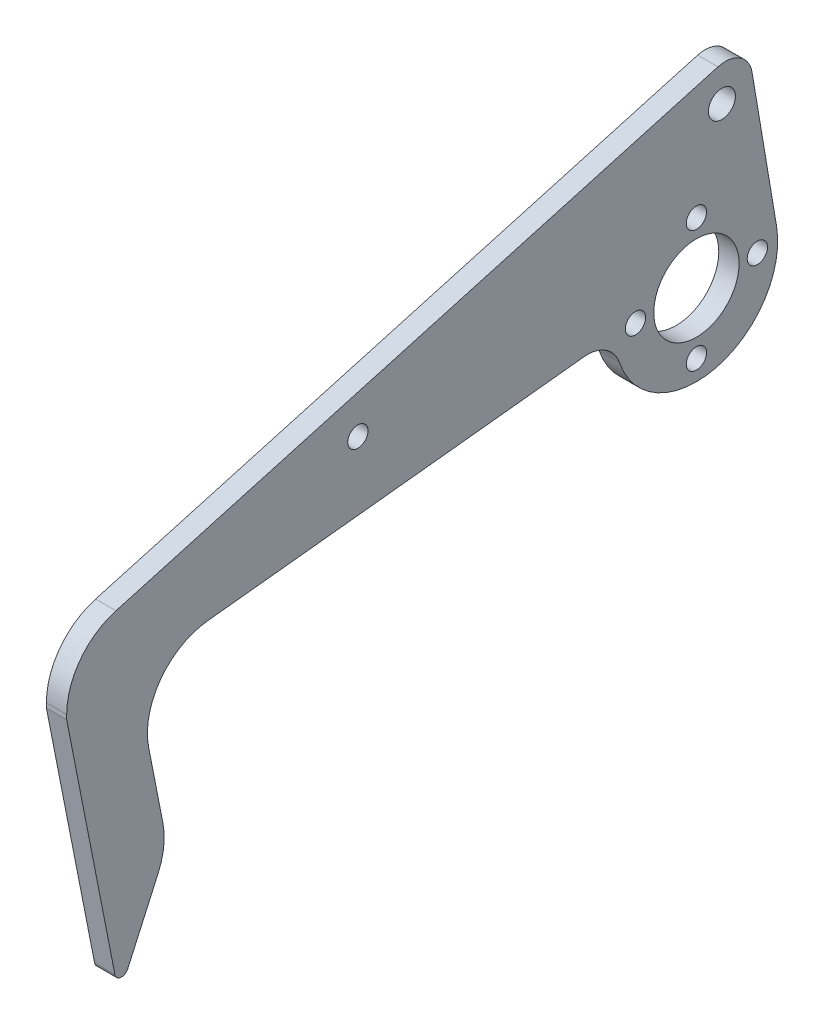
ISO-10303-21;
HEADER;
FILE_DESCRIPTION(('STEP AP214'),'2;1');
FILE_NAME('part.step','',(''),(''),'','','');
FILE_SCHEMA(('AUTOMOTIVE_DESIGN { 1 0 10303 214 1 1 1 1 }'));
ENDSEC;
DATA;
#1=APPLICATION_CONTEXT('core data for automotive mechanical design processes');
#2=APPLICATION_PROTOCOL_DEFINITION('international standard','automotive_design',2000,#1);
#3=PRODUCT_CONTEXT('',#1,'mechanical');
#4=PRODUCT('Part','Part','',(#3));
#5=PRODUCT_RELATED_PRODUCT_CATEGORY('part','',(#4));
#6=PRODUCT_DEFINITION_FORMATION('','',#4);
#7=PRODUCT_DEFINITION_CONTEXT('part definition',#1,'design');
#8=PRODUCT_DEFINITION('design','',#6,#7);
#9=PRODUCT_DEFINITION_SHAPE('','',#8);
#10=(LENGTH_UNIT() NAMED_UNIT(*) SI_UNIT(.MILLI.,.METRE.));
#11=(NAMED_UNIT(*) PLANE_ANGLE_UNIT() SI_UNIT($,.RADIAN.));
#12=(NAMED_UNIT(*) SI_UNIT($,.STERADIAN.) SOLID_ANGLE_UNIT());
#13=UNCERTAINTY_MEASURE_WITH_UNIT(LENGTH_MEASURE(1.E-05),#10,'distance_accuracy_value','');
#14=(GEOMETRIC_REPRESENTATION_CONTEXT(3) GLOBAL_UNCERTAINTY_ASSIGNED_CONTEXT((#13)) GLOBAL_UNIT_ASSIGNED_CONTEXT((#10,
#11,#12)) REPRESENTATION_CONTEXT('',''));
#15=CARTESIAN_POINT('',(0.,0.,0.));
#16=DIRECTION('',(0.,0.,1.));
#17=DIRECTION('',(1.,0.,0.));
#18=AXIS2_PLACEMENT_3D('',#15,#16,#17);
#19=CARTESIAN_POINT('',(3.,0.,0.));
#20=DIRECTION('',(-1.,0.,0.));
#21=DIRECTION('',(0.,0.,1.));
#22=AXIS2_PLACEMENT_3D('',#19,#20,#21);
#23=CYLINDRICAL_SURFACE('',#22,12.);
#24=CARTESIAN_POINT('',(3.,0.,0.));
#25=DIRECTION('',(1.,0.,0.));
#26=DIRECTION('',(0.,0.,-1.));
#27=AXIS2_PLACEMENT_3D('',#24,#25,#26);
#28=CIRCLE('',#27,12.);
#29=CARTESIAN_POINT('',(3.,-3.86044776965129,11.3620835685095));
#30=VERTEX_POINT('',#29);
#31=CARTESIAN_POINT('',(3.,1.99138832062666,-11.8336119826734));
#32=VERTEX_POINT('',#31);
#33=EDGE_CURVE('E267',#30,#32,#28,.T.);
#34=ORIENTED_EDGE('',*,*,#33,.F.);
#35=DIRECTION('',(-1.,0.,0.));
#36=VECTOR('',#35,1.);
#37=CARTESIAN_POINT('',(3.,-3.86044776965129,11.3620835685095));
#38=LINE('',#37,#36);
#39=CARTESIAN_POINT('',(0.,-3.86044776965129,11.3620835685095));
#40=VERTEX_POINT('',#39);
#41=EDGE_CURVE('E54',#30,#40,#38,.T.);
#42=ORIENTED_EDGE('',*,*,#41,.T.);
#43=CARTESIAN_POINT('',(0.,0.,0.));
#44=DIRECTION('',(1.,0.,0.));
#45=DIRECTION('',(0.,0.,-1.));
#46=AXIS2_PLACEMENT_3D('',#43,#44,#45);
#47=CIRCLE('',#46,12.);
#48=CARTESIAN_POINT('',(0.,1.99138832062666,-11.8336119826734));
#49=VERTEX_POINT('',#48);
#50=EDGE_CURVE('E264',#40,#49,#47,.T.);
#51=ORIENTED_EDGE('',*,*,#50,.T.);
#52=DIRECTION('',(1.,0.,0.));
#53=VECTOR('',#52,1.);
#54=CARTESIAN_POINT('',(0.,1.99138832062666,-11.8336119826734));
#55=LINE('',#54,#53);
#56=EDGE_CURVE('E223',#49,#32,#55,.T.);
#57=ORIENTED_EDGE('',*,*,#56,.T.);
#58=EDGE_LOOP('',(#34,#42,#51,#57));
#59=FACE_BOUND('',#58,.T.);
#60=ADVANCED_FACE('F39',(#59),#23,.T.);
#61=CARTESIAN_POINT('',(3.,0.,0.));
#62=DIRECTION('',(1.,0.,0.));
#63=DIRECTION('',(0.,0.,-1.));
#64=AXIS2_PLACEMENT_3D('',#61,#62,#63);
#65=PLANE('',#64);
#66=DIRECTION('',(0.,0.981180262311398,0.19309400003764));
#67=VECTOR('',#66,1.);
#68=CARTESIAN_POINT('',(3.,-8.70416584597603,93.));
#69=LINE('',#68,#67);
#70=CARTESIAN_POINT('',(3.,-44.8725053736254,85.8821546637504));
#71=VERTEX_POINT('',#70);
#72=CARTESIAN_POINT('',(3.,-8.70416584597603,93.));
#73=VERTEX_POINT('',#72);
#74=EDGE_CURVE('E305',#71,#73,#69,.T.);
#75=ORIENTED_EDGE('',*,*,#74,.F.);
#76=CARTESIAN_POINT('',(3.,-44.6794113735878,84.9009744014391));
#77=DIRECTION('',(1.,0.,0.));
#78=DIRECTION('',(0.,0.,-1.));
#79=AXIS2_PLACEMENT_3D('',#76,#77,#78);
#80=CIRCLE('',#79,1.);
#81=CARTESIAN_POINT('',(3.,-45.0896347817384,83.9889893382909));
#82=VERTEX_POINT('',#81);
#83=EDGE_CURVE('E188',#71,#82,#80,.T.);
#84=ORIENTED_EDGE('',*,*,#83,.T.);
#85=DIRECTION('',(0.,-0.911985063148122,0.410223408150628));
#86=VECTOR('',#85,1.);
#87=CARTESIAN_POINT('',(3.,-47.951376338432,85.2762399984944));
#88=LINE('',#87,#86);
#89=CARTESIAN_POINT('',(3.,-35.0654148019241,79.479957501765));
#90=VERTEX_POINT('',#89);
#91=EDGE_CURVE('E300',#90,#82,#88,.T.);
#92=ORIENTED_EDGE('',*,*,#91,.F.);
#93=CARTESIAN_POINT('',(3.,-30.9631807204178,88.5998081332462));
#94=DIRECTION('',(1.,0.,0.));
#95=DIRECTION('',(0.,0.,-1.));
#96=AXIS2_PLACEMENT_3D('',#93,#94,#95);
#97=CIRCLE('',#96,10.);
#98=CARTESIAN_POINT('',(3.,-29.0322407200414,78.7880055101322));
#99=VERTEX_POINT('',#98);
#100=EDGE_CURVE('E164',#90,#99,#97,.T.);
#101=ORIENTED_EDGE('',*,*,#100,.T.);
#102=DIRECTION('',(0.,-0.981180262311398,-0.19309400003764));
#103=VECTOR('',#102,1.);
#104=CARTESIAN_POINT('',(3.,-32.1590840277146,78.172649999059));
#105=LINE('',#104,#103);
#106=CARTESIAN_POINT('',(3.,-18.3372810833477,80.8927487625345));
#107=VERTEX_POINT('',#106);
#108=EDGE_CURVE('E299',#107,#99,#105,.T.);
#109=ORIENTED_EDGE('',*,*,#108,.F.);
#110=CARTESIAN_POINT('',(3.,-16.4063410829713,71.0809461394205));
#111=DIRECTION('',(1.,0.,0.));
#112=DIRECTION('',(0.,0.,-1.));
#113=AXIS2_PLACEMENT_3D('',#110,#111,#112);
#114=CIRCLE('',#113,10.);
#115=CARTESIAN_POINT('',(3.,-6.46358282116851,72.1493833848179));
#116=VERTEX_POINT('',#115);
#117=EDGE_CURVE('E178',#107,#116,#114,.F.);
#118=ORIENTED_EDGE('',*,*,#117,.T.);
#119=DIRECTION('',(0.,-0.106843724539728,0.99427582618028));
#120=VECTOR('',#119,1.);
#121=CARTESIAN_POINT('',(3.,1.274785589867,0.136986977682256));
#122=LINE('',#121,#120);
#123=CARTESIAN_POINT('',(3.,-0.497588542771267,16.6305036780872));
#124=VERTEX_POINT('',#123);
#125=EDGE_CURVE('E197',#124,#116,#122,.T.);
#126=ORIENTED_EDGE('',*,*,#125,.F.);
#127=CARTESIAN_POINT('',(3.,-5.46896767367267,16.0962850553885));
#128=DIRECTION('',(1.,0.,0.));
#129=DIRECTION('',(0.,0.,-1.));
#130=AXIS2_PLACEMENT_3D('',#127,#128,#129);
#131=CIRCLE('',#130,5.);
#132=EDGE_CURVE('E47',#124,#30,#131,.F.);
#133=ORIENTED_EDGE('',*,*,#132,.T.);
#134=ORIENTED_EDGE('',*,*,#33,.T.);
#135=DIRECTION('',(0.,0.986134331889451,0.165949026718888));
#136=VECTOR('',#135,1.);
#137=CARTESIAN_POINT('',(3.,1.99138832062666,-11.8336119826734));
#138=LINE('',#137,#136);
#139=CARTESIAN_POINT('',(3.,23.5115599714681,-8.2121464025856));
#140=VERTEX_POINT('',#139);
#141=EDGE_CURVE('E215',#32,#140,#138,.T.);
#142=ORIENTED_EDGE('',*,*,#141,.T.);
#143=CARTESIAN_POINT('',(3.,22.8477638645925,-4.2676090750278));
#144=DIRECTION('',(1.,0.,0.));
#145=DIRECTION('',(0.,0.,-1.));
#146=AXIS2_PLACEMENT_3D('',#143,#144,#145);
#147=CIRCLE('',#146,4.);
#148=CARTESIAN_POINT('',(3.,26.6971591930867,-3.18033928101759));
#149=VERTEX_POINT('',#148);
#150=EDGE_CURVE('E158',#140,#149,#147,.T.);
#151=ORIENTED_EDGE('',*,*,#150,.T.);
#152=DIRECTION('',(0.,0.271817448502551,-0.962348832123551));
#153=VECTOR('',#152,1.);
#154=CARTESIAN_POINT('',(3.,23.892723580228,6.7485499483835));
#155=LINE('',#154,#153);
#156=CARTESIAN_POINT('',(3.,1.58758729883579,85.7181744850255));
#157=VERTEX_POINT('',#156);
#158=EDGE_CURVE('E141',#157,#149,#155,.T.);
#159=ORIENTED_EDGE('',*,*,#158,.F.);
#160=CARTESIAN_POINT('',(3.,-8.03590102239973,83.));
#161=DIRECTION('',(1.,0.,0.));
#162=DIRECTION('',(0.,0.,-1.));
#163=AXIS2_PLACEMENT_3D('',#160,#161,#162);
#164=CIRCLE('',#163,10.);
#165=CARTESIAN_POINT('',(3.,-8.03590102239973,93.));
#166=VERTEX_POINT('',#165);
#167=EDGE_CURVE('E154',#157,#166,#164,.T.);
#168=ORIENTED_EDGE('',*,*,#167,.T.);
#169=DIRECTION('',(0.,1.,0.));
#170=VECTOR('',#169,1.);
#171=CARTESIAN_POINT('',(3.,-8.70416584597603,93.));
#172=LINE('',#171,#170);
#173=EDGE_CURVE('E205',#73,#166,#172,.T.);
#174=ORIENTED_EDGE('',*,*,#173,.F.);
#175=EDGE_LOOP('',(#75,#84,#92,#101,#109,#118,#126,#133,#134,#142,#151,#159,#168,#174));
#176=FACE_BOUND('',#175,.T.);
#177=CARTESIAN_POINT('',(3.,6.,50.));
#178=DIRECTION('',(-1.,0.,0.));
#179=DIRECTION('',(0.,0.,1.));
#180=AXIS2_PLACEMENT_3D('',#177,#178,#179);
#181=CIRCLE('',#180,1.5);
#182=CARTESIAN_POINT('',(3.,6.,51.5));
#183=VERTEX_POINT('',#182);
#184=EDGE_CURVE('E231',#183,#183,#181,.T.);
#185=ORIENTED_EDGE('',*,*,#184,.T.);
#186=EDGE_LOOP('',(#185));
#187=FACE_BOUND('',#186,.T.);
#188=CARTESIAN_POINT('',(3.,-9.,0.));
#189=DIRECTION('',(1.,0.,0.));
#190=DIRECTION('',(0.,0.,-1.));
#191=AXIS2_PLACEMENT_3D('',#188,#189,#190);
#192=CIRCLE('',#191,1.5);
#193=CARTESIAN_POINT('',(3.,-9.,-1.5));
#194=VERTEX_POINT('',#193);
#195=EDGE_CURVE('E243',#194,#194,#192,.T.);
#196=ORIENTED_EDGE('',*,*,#195,.F.);
#197=EDGE_LOOP('',(#196));
#198=FACE_BOUND('',#197,.T.);
#199=CARTESIAN_POINT('',(3.,0.,0.));
#200=DIRECTION('',(1.,0.,0.));
#201=DIRECTION('',(0.,0.,-1.));
#202=AXIS2_PLACEMENT_3D('',#199,#200,#201);
#203=CIRCLE('',#202,6.3);
#204=CARTESIAN_POINT('',(3.,0.,-6.3));
#205=VERTEX_POINT('',#204);
#206=EDGE_CURVE('E255',#205,#205,#203,.T.);
#207=ORIENTED_EDGE('',*,*,#206,.F.);
#208=EDGE_LOOP('',(#207));
#209=FACE_BOUND('',#208,.T.);
#210=CARTESIAN_POINT('',(3.,9.,0.));
#211=DIRECTION('',(1.,0.,0.));
#212=DIRECTION('',(0.,0.,-1.));
#213=AXIS2_PLACEMENT_3D('',#210,#211,#212);
#214=CIRCLE('',#213,1.5);
#215=CARTESIAN_POINT('',(3.,9.,-1.5));
#216=VERTEX_POINT('',#215);
#217=EDGE_CURVE('E261',#216,#216,#214,.T.);
#218=ORIENTED_EDGE('',*,*,#217,.F.);
#219=EDGE_LOOP('',(#218));
#220=FACE_BOUND('',#219,.T.);
#221=CARTESIAN_POINT('',(3.,0.,-9.));
#222=DIRECTION('',(1.,0.,0.));
#223=DIRECTION('',(0.,0.,-1.));
#224=AXIS2_PLACEMENT_3D('',#221,#222,#223);
#225=CIRCLE('',#224,1.5);
#226=CARTESIAN_POINT('',(3.,0.,-10.5));
#227=VERTEX_POINT('',#226);
#228=EDGE_CURVE('E249',#227,#227,#225,.T.);
#229=ORIENTED_EDGE('',*,*,#228,.F.);
#230=EDGE_LOOP('',(#229));
#231=FACE_BOUND('',#230,.T.);
#232=CARTESIAN_POINT('',(3.,0.,9.));
#233=DIRECTION('',(1.,0.,0.));
#234=DIRECTION('',(0.,0.,-1.));
#235=AXIS2_PLACEMENT_3D('',#232,#233,#234);
#236=CIRCLE('',#235,1.5);
#237=CARTESIAN_POINT('',(3.,0.,7.5));
#238=VERTEX_POINT('',#237);
#239=EDGE_CURVE('E237',#238,#238,#236,.T.);
#240=ORIENTED_EDGE('',*,*,#239,.F.);
#241=EDGE_LOOP('',(#240));
#242=FACE_BOUND('',#241,.T.);
#243=CARTESIAN_POINT('',(3.,21.6761722371468,-3.76079209017824));
#244=DIRECTION('',(1.,0.,0.));
#245=DIRECTION('',(0.,0.,-1.));
#246=AXIS2_PLACEMENT_3D('',#243,#244,#245);
#247=CIRCLE('',#246,2.);
#248=CARTESIAN_POINT('',(3.,21.6761722371468,-5.76079209017824));
#249=VERTEX_POINT('',#248);
#250=EDGE_CURVE('E204',#249,#249,#247,.T.);
#251=ORIENTED_EDGE('',*,*,#250,.F.);
#252=EDGE_LOOP('',(#251));
#253=FACE_BOUND('',#252,.T.);
#254=ADVANCED_FACE('F151',(#176,#187,#198,#209,#220,#231,#242,#253),#65,.T.);
#255=CARTESIAN_POINT('',(0.,0.,0.));
#256=DIRECTION('',(1.,0.,0.));
#257=DIRECTION('',(0.,0.,-1.));
#258=AXIS2_PLACEMENT_3D('',#255,#256,#257);
#259=PLANE('',#258);
#260=DIRECTION('',(0.,-0.271817448502551,0.962348832123551));
#261=VECTOR('',#260,1.);
#262=CARTESIAN_POINT('',(0.,23.892723580228,6.7485499483835));
#263=LINE('',#262,#261);
#264=CARTESIAN_POINT('',(0.,26.6971591930867,-3.1803392810176));
#265=VERTEX_POINT('',#264);
#266=CARTESIAN_POINT('',(0.,1.58758729883578,85.7181744850255));
#267=VERTEX_POINT('',#266);
#268=EDGE_CURVE('E143',#265,#267,#263,.T.);
#269=ORIENTED_EDGE('',*,*,#268,.F.);
#270=CARTESIAN_POINT('',(0.,22.8477638645925,-4.2676090750278));
#271=DIRECTION('',(1.,0.,0.));
#272=DIRECTION('',(0.,0.,-1.));
#273=AXIS2_PLACEMENT_3D('',#270,#271,#272);
#274=CIRCLE('',#273,4.);
#275=CARTESIAN_POINT('',(0.,23.5115599714681,-8.2121464025856));
#276=VERTEX_POINT('',#275);
#277=EDGE_CURVE('E220',#276,#265,#274,.T.);
#278=ORIENTED_EDGE('',*,*,#277,.F.);
#279=DIRECTION('',(0.,0.986134331889451,0.165949026718888));
#280=VECTOR('',#279,1.);
#281=CARTESIAN_POINT('',(0.,1.99138832062666,-11.8336119826734));
#282=LINE('',#281,#280);
#283=EDGE_CURVE('E217',#49,#276,#282,.T.);
#284=ORIENTED_EDGE('',*,*,#283,.F.);
#285=ORIENTED_EDGE('',*,*,#50,.F.);
#286=CARTESIAN_POINT('',(0.,-5.46896767367267,16.0962850553885));
#287=DIRECTION('',(1.,0.,0.));
#288=DIRECTION('',(0.,0.,-1.));
#289=AXIS2_PLACEMENT_3D('',#286,#287,#288);
#290=CIRCLE('',#289,5.);
#291=CARTESIAN_POINT('',(0.,-0.497588542771267,16.6305036780872));
#292=VERTEX_POINT('',#291);
#293=EDGE_CURVE('E11',#40,#292,#290,.T.);
#294=ORIENTED_EDGE('',*,*,#293,.T.);
#295=DIRECTION('',(0.,-0.106843724539728,0.99427582618028));
#296=VECTOR('',#295,1.);
#297=CARTESIAN_POINT('',(0.,1.274785589867,0.136986977682256));
#298=LINE('',#297,#296);
#299=CARTESIAN_POINT('',(0.,-6.46358282116851,72.1493833848178));
#300=VERTEX_POINT('',#299);
#301=EDGE_CURVE('E198',#292,#300,#298,.T.);
#302=ORIENTED_EDGE('',*,*,#301,.T.);
#303=CARTESIAN_POINT('',(0.,-16.4063410829713,71.0809461394205));
#304=DIRECTION('',(1.,0.,0.));
#305=DIRECTION('',(0.,0.,-1.));
#306=AXIS2_PLACEMENT_3D('',#303,#304,#305);
#307=CIRCLE('',#306,10.);
#308=CARTESIAN_POINT('',(0.,-18.3372810833477,80.8927487625345));
#309=VERTEX_POINT('',#308);
#310=EDGE_CURVE('E176',#300,#309,#307,.T.);
#311=ORIENTED_EDGE('',*,*,#310,.T.);
#312=DIRECTION('',(0.,-0.981180262311398,-0.19309400003764));
#313=VECTOR('',#312,1.);
#314=CARTESIAN_POINT('',(0.,-32.1590840277146,78.172649999059));
#315=LINE('',#314,#313);
#316=CARTESIAN_POINT('',(0.,-29.0322407200414,78.7880055101322));
#317=VERTEX_POINT('',#316);
#318=EDGE_CURVE('E285',#309,#317,#315,.T.);
#319=ORIENTED_EDGE('',*,*,#318,.T.);
#320=CARTESIAN_POINT('',(0.,-30.9631807204178,88.5998081332462));
#321=DIRECTION('',(1.,0.,0.));
#322=DIRECTION('',(0.,0.,-1.));
#323=AXIS2_PLACEMENT_3D('',#320,#321,#322);
#324=CIRCLE('',#323,10.);
#325=CARTESIAN_POINT('',(0.,-35.0654148019241,79.479957501765));
#326=VERTEX_POINT('',#325);
#327=EDGE_CURVE('E168',#317,#326,#324,.F.);
#328=ORIENTED_EDGE('',*,*,#327,.T.);
#329=DIRECTION('',(0.,-0.911985063148122,0.410223408150628));
#330=VECTOR('',#329,1.);
#331=CARTESIAN_POINT('',(0.,-47.951376338432,85.2762399984944));
#332=LINE('',#331,#330);
#333=CARTESIAN_POINT('',(0.,-45.0896347817384,83.9889893382909));
#334=VERTEX_POINT('',#333);
#335=EDGE_CURVE('E283',#326,#334,#332,.T.);
#336=ORIENTED_EDGE('',*,*,#335,.T.);
#337=CARTESIAN_POINT('',(0.,-44.6794113735878,84.9009744014391));
#338=DIRECTION('',(1.,0.,0.));
#339=DIRECTION('',(0.,0.,-1.));
#340=AXIS2_PLACEMENT_3D('',#337,#338,#339);
#341=CIRCLE('',#340,1.);
#342=CARTESIAN_POINT('',(0.,-44.8725053736254,85.8821546637504));
#343=VERTEX_POINT('',#342);
#344=EDGE_CURVE('E184',#334,#343,#341,.F.);
#345=ORIENTED_EDGE('',*,*,#344,.T.);
#346=DIRECTION('',(0.,0.981180262311398,0.19309400003764));
#347=VECTOR('',#346,1.);
#348=CARTESIAN_POINT('',(0.,-8.70416584597603,93.));
#349=LINE('',#348,#347);
#350=CARTESIAN_POINT('',(0.,-8.70416584597603,93.));
#351=VERTEX_POINT('',#350);
#352=EDGE_CURVE('E294',#343,#351,#349,.T.);
#353=ORIENTED_EDGE('',*,*,#352,.T.);
#354=DIRECTION('',(0.,1.,0.));
#355=VECTOR('',#354,1.);
#356=CARTESIAN_POINT('',(0.,-8.70416584597603,93.));
#357=LINE('',#356,#355);
#358=CARTESIAN_POINT('',(0.,-8.03590102239973,93.));
#359=VERTEX_POINT('',#358);
#360=EDGE_CURVE('E310',#351,#359,#357,.T.);
#361=ORIENTED_EDGE('',*,*,#360,.T.);
#362=CARTESIAN_POINT('',(0.,-8.03590102239973,83.));
#363=DIRECTION('',(1.,0.,0.));
#364=DIRECTION('',(0.,0.,-1.));
#365=AXIS2_PLACEMENT_3D('',#362,#363,#364);
#366=CIRCLE('',#365,10.);
#367=EDGE_CURVE('E276',#359,#267,#366,.F.);
#368=ORIENTED_EDGE('',*,*,#367,.T.);
#369=EDGE_LOOP('',(#269,#278,#284,#285,#294,#302,#311,#319,#328,#336,#345,#353,#361,#368));
#370=FACE_BOUND('',#369,.T.);
#371=CARTESIAN_POINT('',(0.,6.,50.));
#372=DIRECTION('',(-1.,0.,0.));
#373=DIRECTION('',(0.,0.,1.));
#374=AXIS2_PLACEMENT_3D('',#371,#372,#373);
#375=CIRCLE('',#374,1.5);
#376=CARTESIAN_POINT('',(0.,6.,51.5));
#377=VERTEX_POINT('',#376);
#378=EDGE_CURVE('E228',#377,#377,#375,.T.);
#379=ORIENTED_EDGE('',*,*,#378,.F.);
#380=EDGE_LOOP('',(#379));
#381=FACE_BOUND('',#380,.T.);
#382=CARTESIAN_POINT('',(0.,9.,0.));
#383=DIRECTION('',(1.,0.,0.));
#384=DIRECTION('',(0.,0.,-1.));
#385=AXIS2_PLACEMENT_3D('',#382,#383,#384);
#386=CIRCLE('',#385,1.5);
#387=CARTESIAN_POINT('',(0.,9.,-1.5));
#388=VERTEX_POINT('',#387);
#389=EDGE_CURVE('E258',#388,#388,#386,.T.);
#390=ORIENTED_EDGE('',*,*,#389,.T.);
#391=EDGE_LOOP('',(#390));
#392=FACE_BOUND('',#391,.T.);
#393=CARTESIAN_POINT('',(0.,0.,0.));
#394=DIRECTION('',(1.,0.,0.));
#395=DIRECTION('',(0.,0.,-1.));
#396=AXIS2_PLACEMENT_3D('',#393,#394,#395);
#397=CIRCLE('',#396,6.3);
#398=CARTESIAN_POINT('',(0.,0.,-6.3));
#399=VERTEX_POINT('',#398);
#400=EDGE_CURVE('E252',#399,#399,#397,.T.);
#401=ORIENTED_EDGE('',*,*,#400,.T.);
#402=EDGE_LOOP('',(#401));
#403=FACE_BOUND('',#402,.T.);
#404=CARTESIAN_POINT('',(0.,0.,-9.));
#405=DIRECTION('',(1.,0.,0.));
#406=DIRECTION('',(0.,0.,-1.));
#407=AXIS2_PLACEMENT_3D('',#404,#405,#406);
#408=CIRCLE('',#407,1.5);
#409=CARTESIAN_POINT('',(0.,0.,-10.5));
#410=VERTEX_POINT('',#409);
#411=EDGE_CURVE('E246',#410,#410,#408,.T.);
#412=ORIENTED_EDGE('',*,*,#411,.T.);
#413=EDGE_LOOP('',(#412));
#414=FACE_BOUND('',#413,.T.);
#415=CARTESIAN_POINT('',(0.,-9.,0.));
#416=DIRECTION('',(1.,0.,0.));
#417=DIRECTION('',(0.,0.,-1.));
#418=AXIS2_PLACEMENT_3D('',#415,#416,#417);
#419=CIRCLE('',#418,1.5);
#420=CARTESIAN_POINT('',(0.,-9.,-1.5));
#421=VERTEX_POINT('',#420);
#422=EDGE_CURVE('E240',#421,#421,#419,.T.);
#423=ORIENTED_EDGE('',*,*,#422,.T.);
#424=EDGE_LOOP('',(#423));
#425=FACE_BOUND('',#424,.T.);
#426=CARTESIAN_POINT('',(0.,0.,9.));
#427=DIRECTION('',(1.,0.,0.));
#428=DIRECTION('',(0.,0.,-1.));
#429=AXIS2_PLACEMENT_3D('',#426,#427,#428);
#430=CIRCLE('',#429,1.5);
#431=CARTESIAN_POINT('',(0.,0.,7.5));
#432=VERTEX_POINT('',#431);
#433=EDGE_CURVE('E234',#432,#432,#430,.T.);
#434=ORIENTED_EDGE('',*,*,#433,.T.);
#435=EDGE_LOOP('',(#434));
#436=FACE_BOUND('',#435,.T.);
#437=CARTESIAN_POINT('',(0.,21.6761722371468,-3.76079209017824));
#438=DIRECTION('',(1.,0.,0.));
#439=DIRECTION('',(0.,0.,-1.));
#440=AXIS2_PLACEMENT_3D('',#437,#438,#439);
#441=CIRCLE('',#440,2.);
#442=CARTESIAN_POINT('',(0.,21.6761722371468,-5.76079209017824));
#443=VERTEX_POINT('',#442);
#444=EDGE_CURVE('E208',#443,#443,#441,.T.);
#445=ORIENTED_EDGE('',*,*,#444,.T.);
#446=EDGE_LOOP('',(#445));
#447=FACE_BOUND('',#446,.T.);
#448=ADVANCED_FACE('F281',(#370,#381,#392,#403,#414,#425,#436,#447),#259,.F.);
#449=CARTESIAN_POINT('',(3.,9.,0.));
#450=DIRECTION('',(-1.,0.,0.));
#451=DIRECTION('',(0.,0.,1.));
#452=AXIS2_PLACEMENT_3D('',#449,#450,#451);
#453=CYLINDRICAL_SURFACE('',#452,1.5);
#454=ORIENTED_EDGE('',*,*,#217,.T.);
#455=EDGE_LOOP('',(#454));
#456=FACE_BOUND('',#455,.T.);
#457=ORIENTED_EDGE('',*,*,#389,.F.);
#458=EDGE_LOOP('',(#457));
#459=FACE_BOUND('',#458,.T.);
#460=ADVANCED_FACE('F442',(#456,#459),#453,.F.);
#461=CARTESIAN_POINT('',(3.,0.,0.));
#462=DIRECTION('',(-1.,0.,0.));
#463=DIRECTION('',(0.,0.,1.));
#464=AXIS2_PLACEMENT_3D('',#461,#462,#463);
#465=CYLINDRICAL_SURFACE('',#464,6.3);
#466=ORIENTED_EDGE('',*,*,#206,.T.);
#467=EDGE_LOOP('',(#466));
#468=FACE_BOUND('',#467,.T.);
#469=ORIENTED_EDGE('',*,*,#400,.F.);
#470=EDGE_LOOP('',(#469));
#471=FACE_BOUND('',#470,.T.);
#472=ADVANCED_FACE('F513',(#468,#471),#465,.F.);
#473=CARTESIAN_POINT('',(3.,0.,-9.));
#474=DIRECTION('',(-1.,0.,0.));
#475=DIRECTION('',(0.,0.,1.));
#476=AXIS2_PLACEMENT_3D('',#473,#474,#475);
#477=CYLINDRICAL_SURFACE('',#476,1.5);
#478=ORIENTED_EDGE('',*,*,#228,.T.);
#479=EDGE_LOOP('',(#478));
#480=FACE_BOUND('',#479,.T.);
#481=ORIENTED_EDGE('',*,*,#411,.F.);
#482=EDGE_LOOP('',(#481));
#483=FACE_BOUND('',#482,.T.);
#484=ADVANCED_FACE('F522',(#480,#483),#477,.F.);
#485=CARTESIAN_POINT('',(3.,-9.,0.));
#486=DIRECTION('',(-1.,0.,0.));
#487=DIRECTION('',(0.,0.,1.));
#488=AXIS2_PLACEMENT_3D('',#485,#486,#487);
#489=CYLINDRICAL_SURFACE('',#488,1.5);
#490=ORIENTED_EDGE('',*,*,#195,.T.);
#491=EDGE_LOOP('',(#490));
#492=FACE_BOUND('',#491,.T.);
#493=ORIENTED_EDGE('',*,*,#422,.F.);
#494=EDGE_LOOP('',(#493));
#495=FACE_BOUND('',#494,.T.);
#496=ADVANCED_FACE('F531',(#492,#495),#489,.F.);
#497=CARTESIAN_POINT('',(3.,0.,9.));
#498=DIRECTION('',(-1.,0.,0.));
#499=DIRECTION('',(0.,0.,1.));
#500=AXIS2_PLACEMENT_3D('',#497,#498,#499);
#501=CYLINDRICAL_SURFACE('',#500,1.5);
#502=ORIENTED_EDGE('',*,*,#239,.T.);
#503=EDGE_LOOP('',(#502));
#504=FACE_BOUND('',#503,.T.);
#505=ORIENTED_EDGE('',*,*,#433,.F.);
#506=EDGE_LOOP('',(#505));
#507=FACE_BOUND('',#506,.T.);
#508=ADVANCED_FACE('F492',(#504,#507),#501,.F.);
#509=CARTESIAN_POINT('',(3.,6.,50.));
#510=DIRECTION('',(-1.,0.,0.));
#511=DIRECTION('',(0.,0.,1.));
#512=AXIS2_PLACEMENT_3D('',#509,#510,#511);
#513=CYLINDRICAL_SURFACE('',#512,1.5);
#514=ORIENTED_EDGE('',*,*,#184,.F.);
#515=EDGE_LOOP('',(#514));
#516=FACE_BOUND('',#515,.T.);
#517=ORIENTED_EDGE('',*,*,#378,.T.);
#518=EDGE_LOOP('',(#517));
#519=FACE_BOUND('',#518,.T.);
#520=ADVANCED_FACE('F390',(#516,#519),#513,.F.);
#521=CARTESIAN_POINT('',(0.,22.8477638645925,-4.2676090750278));
#522=DIRECTION('',(1.,0.,0.));
#523=DIRECTION('',(0.,0.,-1.));
#524=AXIS2_PLACEMENT_3D('',#521,#522,#523);
#525=CYLINDRICAL_SURFACE('',#524,4.);
#526=DIRECTION('',(1.,0.,0.));
#527=VECTOR('',#526,1.);
#528=CARTESIAN_POINT('',(-92.3766006655577,26.6971591930867,-3.18033928101759));
#529=LINE('',#528,#527);
#530=EDGE_CURVE('E147',#265,#149,#529,.T.);
#531=ORIENTED_EDGE('',*,*,#530,.T.);
#532=ORIENTED_EDGE('',*,*,#150,.F.);
#533=DIRECTION('',(1.,0.,0.));
#534=VECTOR('',#533,1.);
#535=CARTESIAN_POINT('',(0.,23.5115599714681,-8.2121464025856));
#536=LINE('',#535,#534);
#537=EDGE_CURVE('E226',#276,#140,#536,.T.);
#538=ORIENTED_EDGE('',*,*,#537,.F.);
#539=ORIENTED_EDGE('',*,*,#277,.T.);
#540=EDGE_LOOP('',(#531,#532,#538,#539));
#541=FACE_BOUND('',#540,.T.);
#542=ADVANCED_FACE('F385',(#541),#525,.T.);
#543=CARTESIAN_POINT('',(0.,1.99138832062666,-11.8336119826734));
#544=DIRECTION('',(0.,0.165949026718888,-0.986134331889451));
#545=DIRECTION('',(0.,0.986134331889451,0.165949026718888));
#546=AXIS2_PLACEMENT_3D('',#543,#544,#545);
#547=PLANE('',#546);
#548=ORIENTED_EDGE('',*,*,#141,.F.);
#549=ORIENTED_EDGE('',*,*,#56,.F.);
#550=ORIENTED_EDGE('',*,*,#283,.T.);
#551=ORIENTED_EDGE('',*,*,#537,.T.);
#552=EDGE_LOOP('',(#548,#549,#550,#551));
#553=FACE_BOUND('',#552,.T.);
#554=ADVANCED_FACE('F389',(#553),#547,.T.);
#555=CARTESIAN_POINT('',(0.,21.6761722371468,-3.76079209017824));
#556=DIRECTION('',(1.,0.,0.));
#557=DIRECTION('',(0.,0.,-1.));
#558=AXIS2_PLACEMENT_3D('',#555,#556,#557);
#559=CYLINDRICAL_SURFACE('',#558,2.);
#560=ORIENTED_EDGE('',*,*,#444,.F.);
#561=EDGE_LOOP('',(#560));
#562=FACE_BOUND('',#561,.T.);
#563=ORIENTED_EDGE('',*,*,#250,.T.);
#564=EDGE_LOOP('',(#563));
#565=FACE_BOUND('',#564,.T.);
#566=ADVANCED_FACE('F406',(#562,#565),#559,.F.);
#567=CARTESIAN_POINT('',(-7.,1.274785589867,0.136986977682256));
#568=DIRECTION('',(0.,0.99427582618028,0.106843724539728));
#569=DIRECTION('',(0.,-0.106843724539728,0.99427582618028));
#570=AXIS2_PLACEMENT_3D('',#567,#568,#569);
#571=PLANE('',#570);
#572=ORIENTED_EDGE('',*,*,#301,.F.);
#573=DIRECTION('',(1.,0.,0.));
#574=VECTOR('',#573,1.);
#575=CARTESIAN_POINT('',(3.,-0.497588542771265,16.6305036780872));
#576=LINE('',#575,#574);
#577=EDGE_CURVE('E190',#292,#124,#576,.T.);
#578=ORIENTED_EDGE('',*,*,#577,.T.);
#579=ORIENTED_EDGE('',*,*,#125,.T.);
#580=DIRECTION('',(-1.,0.,0.));
#581=VECTOR('',#580,1.);
#582=CARTESIAN_POINT('',(-7.,-6.46358282116851,72.1493833848178));
#583=LINE('',#582,#581);
#584=EDGE_CURVE('E173',#116,#300,#583,.T.);
#585=ORIENTED_EDGE('',*,*,#584,.T.);
#586=EDGE_LOOP('',(#572,#578,#579,#585));
#587=FACE_BOUND('',#586,.T.);
#588=ADVANCED_FACE('F196',(#587),#571,.F.);
#589=CARTESIAN_POINT('',(22.0259690462828,-8.70416584597603,93.));
#590=DIRECTION('',(0.,0.,1.));
#591=DIRECTION('',(1.,0.,0.));
#592=AXIS2_PLACEMENT_3D('',#589,#590,#591);
#593=PLANE('',#592);
#594=ORIENTED_EDGE('',*,*,#173,.T.);
#595=DIRECTION('',(-1.,0.,0.));
#596=VECTOR('',#595,1.);
#597=CARTESIAN_POINT('',(22.0259690462828,-8.03590102239973,93.));
#598=LINE('',#597,#596);
#599=EDGE_CURVE('E163',#166,#359,#598,.T.);
#600=ORIENTED_EDGE('',*,*,#599,.T.);
#601=ORIENTED_EDGE('',*,*,#360,.F.);
#602=DIRECTION('',(-1.,0.,0.));
#603=VECTOR('',#602,1.);
#604=CARTESIAN_POINT('',(22.0259690462828,-8.70416584597603,93.));
#605=LINE('',#604,#603);
#606=EDGE_CURVE('E210',#73,#351,#605,.T.);
#607=ORIENTED_EDGE('',*,*,#606,.F.);
#608=EDGE_LOOP('',(#594,#600,#601,#607));
#609=FACE_BOUND('',#608,.T.);
#610=ADVANCED_FACE('F321',(#609),#593,.T.);
#611=CARTESIAN_POINT('',(45.961584840906,-32.1590840277146,78.172649999059));
#612=DIRECTION('',(0.,0.19309400003764,-0.981180262311398));
#613=DIRECTION('',(0.,0.981180262311398,0.19309400003764));
#614=AXIS2_PLACEMENT_3D('',#611,#612,#613);
#615=PLANE('',#614);
#616=ORIENTED_EDGE('',*,*,#108,.T.);
#617=DIRECTION('',(-1.,0.,0.));
#618=VECTOR('',#617,1.);
#619=CARTESIAN_POINT('',(45.961584840906,-29.0322407200414,78.7880055101322));
#620=LINE('',#619,#618);
#621=EDGE_CURVE('E273',#99,#317,#620,.T.);
#622=ORIENTED_EDGE('',*,*,#621,.T.);
#623=ORIENTED_EDGE('',*,*,#318,.F.);
#624=DIRECTION('',(-1.,0.,0.));
#625=VECTOR('',#624,1.);
#626=CARTESIAN_POINT('',(45.961584840906,-18.3372810833477,80.8927487625345));
#627=LINE('',#626,#625);
#628=EDGE_CURVE('E271',#309,#107,#627,.F.);
#629=ORIENTED_EDGE('',*,*,#628,.T.);
#630=EDGE_LOOP('',(#616,#622,#623,#629));
#631=FACE_BOUND('',#630,.T.);
#632=ADVANCED_FACE('F302',(#631),#615,.T.);
#633=CARTESIAN_POINT('',(45.961584840906,-47.951376338432,85.2762399984944));
#634=DIRECTION('',(0.,-0.410223408150628,-0.911985063148122));
#635=DIRECTION('',(0.,0.911985063148122,-0.410223408150628));
#636=AXIS2_PLACEMENT_3D('',#633,#634,#635);
#637=PLANE('',#636);
#638=ORIENTED_EDGE('',*,*,#91,.T.);
#639=DIRECTION('',(-1.,0.,0.));
#640=VECTOR('',#639,1.);
#641=CARTESIAN_POINT('',(45.961584840906,-45.0896347817384,83.9889893382909));
#642=LINE('',#641,#640);
#643=EDGE_CURVE('E181',#82,#334,#642,.T.);
#644=ORIENTED_EDGE('',*,*,#643,.T.);
#645=ORIENTED_EDGE('',*,*,#335,.F.);
#646=DIRECTION('',(-1.,0.,0.));
#647=VECTOR('',#646,1.);
#648=CARTESIAN_POINT('',(45.961584840906,-35.0654148019241,79.479957501765));
#649=LINE('',#648,#647);
#650=EDGE_CURVE('E165',#326,#90,#649,.F.);
#651=ORIENTED_EDGE('',*,*,#650,.T.);
#652=EDGE_LOOP('',(#638,#644,#645,#651));
#653=FACE_BOUND('',#652,.T.);
#654=ADVANCED_FACE('F291',(#653),#637,.T.);
#655=CARTESIAN_POINT('',(45.961584840906,-8.70416584597603,93.));
#656=DIRECTION('',(0.,-0.19309400003764,0.981180262311398));
#657=DIRECTION('',(0.,-0.981180262311398,-0.19309400003764));
#658=AXIS2_PLACEMENT_3D('',#655,#656,#657);
#659=PLANE('',#658);
#660=ORIENTED_EDGE('',*,*,#352,.F.);
#661=DIRECTION('',(-1.,0.,0.));
#662=VECTOR('',#661,1.);
#663=CARTESIAN_POINT('',(45.961584840906,-44.8725053736254,85.8821546637504));
#664=LINE('',#663,#662);
#665=EDGE_CURVE('E186',#343,#71,#664,.F.);
#666=ORIENTED_EDGE('',*,*,#665,.T.);
#667=ORIENTED_EDGE('',*,*,#74,.T.);
#668=ORIENTED_EDGE('',*,*,#606,.T.);
#669=EDGE_LOOP('',(#660,#666,#667,#668));
#670=FACE_BOUND('',#669,.T.);
#671=ADVANCED_FACE('F318',(#670),#659,.T.);
#672=CARTESIAN_POINT('',(45.961584840906,-30.9631807204178,88.5998081332462));
#673=DIRECTION('',(-1.,0.,0.));
#674=DIRECTION('',(0.,0.,1.));
#675=AXIS2_PLACEMENT_3D('',#672,#673,#674);
#676=CYLINDRICAL_SURFACE('',#675,10.);
#677=ORIENTED_EDGE('',*,*,#100,.F.);
#678=ORIENTED_EDGE('',*,*,#650,.F.);
#679=ORIENTED_EDGE('',*,*,#327,.F.);
#680=ORIENTED_EDGE('',*,*,#621,.F.);
#681=EDGE_LOOP('',(#677,#678,#679,#680));
#682=FACE_BOUND('',#681,.T.);
#683=ADVANCED_FACE('F297',(#682),#676,.T.);
#684=CARTESIAN_POINT('',(22.0259690462828,-8.03590102239973,83.));
#685=DIRECTION('',(-1.,0.,0.));
#686=DIRECTION('',(0.,0.,1.));
#687=AXIS2_PLACEMENT_3D('',#684,#685,#686);
#688=CYLINDRICAL_SURFACE('',#687,10.);
#689=DIRECTION('',(1.,0.,0.));
#690=VECTOR('',#689,1.);
#691=CARTESIAN_POINT('',(-92.3766006655577,1.58758729883579,85.7181744850255));
#692=LINE('',#691,#690);
#693=EDGE_CURVE('E137',#267,#157,#692,.T.);
#694=ORIENTED_EDGE('',*,*,#693,.F.);
#695=ORIENTED_EDGE('',*,*,#367,.F.);
#696=ORIENTED_EDGE('',*,*,#599,.F.);
#697=ORIENTED_EDGE('',*,*,#167,.F.);
#698=EDGE_LOOP('',(#694,#695,#696,#697));
#699=FACE_BOUND('',#698,.T.);
#700=ADVANCED_FACE('F161',(#699),#688,.T.);
#701=CARTESIAN_POINT('',(-7.,-16.4063410829713,71.0809461394205));
#702=DIRECTION('',(-1.,0.,0.));
#703=DIRECTION('',(0.,0.,1.));
#704=AXIS2_PLACEMENT_3D('',#701,#702,#703);
#705=CYLINDRICAL_SURFACE('',#704,10.);
#706=ORIENTED_EDGE('',*,*,#117,.F.);
#707=ORIENTED_EDGE('',*,*,#628,.F.);
#708=ORIENTED_EDGE('',*,*,#310,.F.);
#709=ORIENTED_EDGE('',*,*,#584,.F.);
#710=EDGE_LOOP('',(#706,#707,#708,#709));
#711=FACE_BOUND('',#710,.T.);
#712=ADVANCED_FACE('F326',(#711),#705,.F.);
#713=CARTESIAN_POINT('',(45.961584840906,-44.6794113735878,84.9009744014391));
#714=DIRECTION('',(-1.,0.,0.));
#715=DIRECTION('',(0.,0.,1.));
#716=AXIS2_PLACEMENT_3D('',#713,#714,#715);
#717=CYLINDRICAL_SURFACE('',#716,1.);
#718=ORIENTED_EDGE('',*,*,#83,.F.);
#719=ORIENTED_EDGE('',*,*,#665,.F.);
#720=ORIENTED_EDGE('',*,*,#344,.F.);
#721=ORIENTED_EDGE('',*,*,#643,.F.);
#722=EDGE_LOOP('',(#718,#719,#720,#721));
#723=FACE_BOUND('',#722,.T.);
#724=ADVANCED_FACE('F324',(#723),#717,.T.);
#725=CARTESIAN_POINT('',(-92.3766006655577,23.892723580228,6.7485499483835));
#726=DIRECTION('',(0.,-0.962348832123551,-0.271817448502551));
#727=DIRECTION('',(0.,0.271817448502551,-0.962348832123551));
#728=AXIS2_PLACEMENT_3D('',#725,#726,#727);
#729=PLANE('',#728);
#730=ORIENTED_EDGE('',*,*,#530,.F.);
#731=ORIENTED_EDGE('',*,*,#268,.T.);
#732=ORIENTED_EDGE('',*,*,#693,.T.);
#733=ORIENTED_EDGE('',*,*,#158,.T.);
#734=EDGE_LOOP('',(#730,#731,#732,#733));
#735=FACE_BOUND('',#734,.T.);
#736=ADVANCED_FACE('F140',(#735),#729,.F.);
#737=CARTESIAN_POINT('',(3.,-5.46896767367267,16.0962850553885));
#738=DIRECTION('',(-1.,0.,0.));
#739=DIRECTION('',(0.,0.,1.));
#740=AXIS2_PLACEMENT_3D('',#737,#738,#739);
#741=CYLINDRICAL_SURFACE('',#740,5.);
#742=ORIENTED_EDGE('',*,*,#293,.F.);
#743=ORIENTED_EDGE('',*,*,#41,.F.);
#744=ORIENTED_EDGE('',*,*,#132,.F.);
#745=ORIENTED_EDGE('',*,*,#577,.F.);
#746=EDGE_LOOP('',(#742,#743,#744,#745));
#747=FACE_BOUND('',#746,.T.);
#748=ADVANCED_FACE('F41',(#747),#741,.F.);
#749=CLOSED_SHELL('',(#60,#254,#448,#460,#472,#484,#496,#508,#520,#542,#554,#566,#588,#610,#632,
#654,#671,#683,#700,#712,#724,#736,#748));
#750=MANIFOLD_SOLID_BREP('B2',#749);
#751=ADVANCED_BREP_SHAPE_REPRESENTATION('',(#18,#750),#14);
#752=SHAPE_DEFINITION_REPRESENTATION(#9,#751);
ENDSEC;
END-ISO-10303-21;
